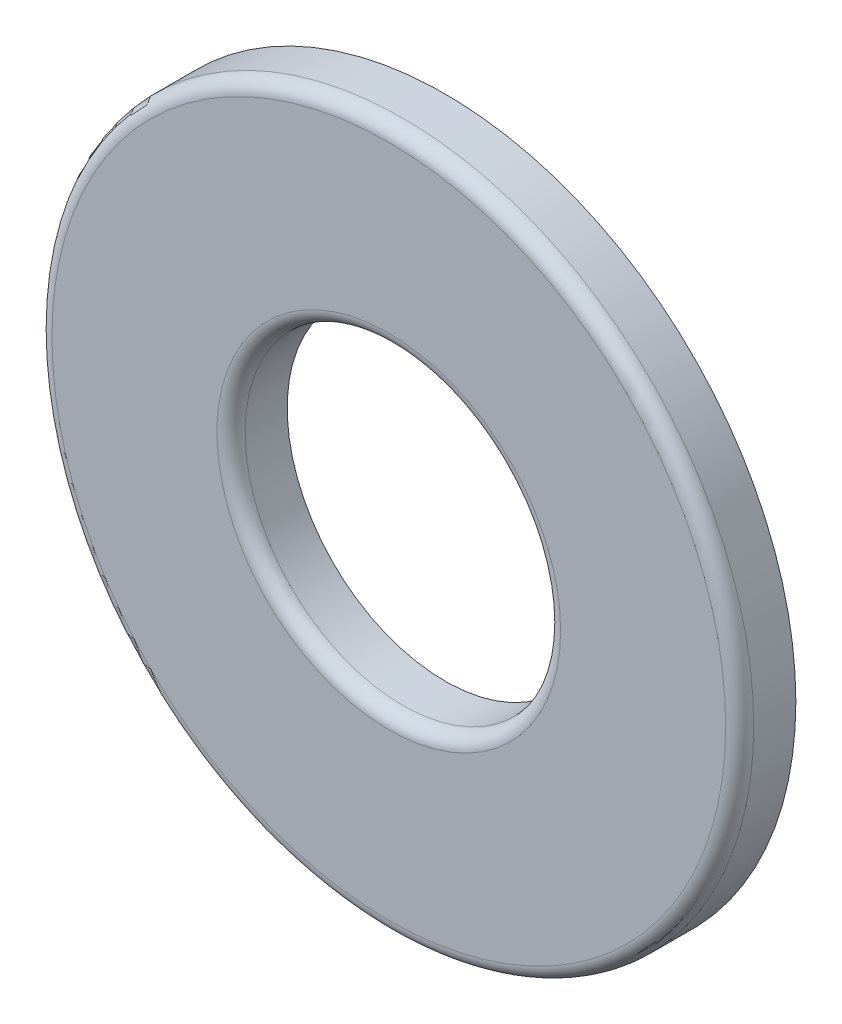
ISO-10303-21;
HEADER;
FILE_DESCRIPTION(('STEP AP214'),'2;1');
FILE_NAME('part.step','',(''),(''),'','','');
FILE_SCHEMA(('AUTOMOTIVE_DESIGN { 1 0 10303 214 1 1 1 1 }'));
ENDSEC;
DATA;
#1=APPLICATION_CONTEXT('core data for automotive mechanical design processes');
#2=APPLICATION_PROTOCOL_DEFINITION('international standard','automotive_design',2000,#1);
#3=PRODUCT_CONTEXT('',#1,'mechanical');
#4=PRODUCT('Part','Part','',(#3));
#5=PRODUCT_RELATED_PRODUCT_CATEGORY('part','',(#4));
#6=PRODUCT_DEFINITION_FORMATION('','',#4);
#7=PRODUCT_DEFINITION_CONTEXT('part definition',#1,'design');
#8=PRODUCT_DEFINITION('design','',#6,#7);
#9=PRODUCT_DEFINITION_SHAPE('','',#8);
#10=(LENGTH_UNIT() NAMED_UNIT(*) SI_UNIT(.MILLI.,.METRE.));
#11=(NAMED_UNIT(*) PLANE_ANGLE_UNIT() SI_UNIT($,.RADIAN.));
#12=(NAMED_UNIT(*) SI_UNIT($,.STERADIAN.) SOLID_ANGLE_UNIT());
#13=UNCERTAINTY_MEASURE_WITH_UNIT(LENGTH_MEASURE(1.E-05),#10,'distance_accuracy_value','');
#14=(GEOMETRIC_REPRESENTATION_CONTEXT(3) GLOBAL_UNCERTAINTY_ASSIGNED_CONTEXT((#13)) GLOBAL_UNIT_ASSIGNED_CONTEXT((#10,
#11,#12)) REPRESENTATION_CONTEXT('',''));
#15=CARTESIAN_POINT('',(0.,0.,0.));
#16=DIRECTION('',(0.,0.,1.));
#17=DIRECTION('',(1.,0.,0.));
#18=AXIS2_PLACEMENT_3D('',#15,#16,#17);
#19=CARTESIAN_POINT('',(0.,0.,0.634999999999997));
#20=DIRECTION('',(0.,0.,1.));
#21=DIRECTION('',(1.,0.,0.));
#22=AXIS2_PLACEMENT_3D('',#19,#20,#21);
#23=PLANE('',#22);
#24=CARTESIAN_POINT('',(0.,0.,0.634999999999997));
#25=DIRECTION('',(0.,0.,1.));
#26=DIRECTION('',(1.,0.,0.));
#27=AXIS2_PLACEMENT_3D('',#24,#25,#26);
#28=CIRCLE('',#27,7.62);
#29=CARTESIAN_POINT('',(7.62,0.,0.634999999999997));
#30=VERTEX_POINT('',#29);
#31=EDGE_CURVE('E46',#30,#30,#28,.T.);
#32=ORIENTED_EDGE('',*,*,#31,.T.);
#33=EDGE_LOOP('',(#32));
#34=FACE_BOUND('',#33,.T.);
#35=CARTESIAN_POINT('',(0.,0.,0.634999999999997));
#36=DIRECTION('',(0.,0.,1.));
#37=DIRECTION('',(1.,0.,0.));
#38=AXIS2_PLACEMENT_3D('',#35,#36,#37);
#39=CIRCLE('',#38,3.8862);
#40=CARTESIAN_POINT('',(3.8862,0.,0.634999999999997));
#41=VERTEX_POINT('',#40);
#42=EDGE_CURVE('E50',#41,#41,#39,.F.);
#43=ORIENTED_EDGE('',*,*,#42,.T.);
#44=EDGE_LOOP('',(#43));
#45=FACE_BOUND('',#44,.T.);
#46=ADVANCED_FACE('F35',(#34,#45),#23,.T.);
#47=CARTESIAN_POINT('',(0.,0.,0.634999999999997));
#48=DIRECTION('',(0.,0.,-1.));
#49=DIRECTION('',(-1.,0.,0.));
#50=AXIS2_PLACEMENT_3D('',#47,#48,#49);
#51=CYLINDRICAL_SURFACE('',#50,7.9375);
#52=CARTESIAN_POINT('',(0.,0.,0.317499999999997));
#53=DIRECTION('',(0.,0.,1.));
#54=DIRECTION('',(1.,0.,0.));
#55=AXIS2_PLACEMENT_3D('',#52,#53,#54);
#56=CIRCLE('',#55,7.9375);
#57=CARTESIAN_POINT('',(7.9375,0.,0.317499999999997));
#58=VERTEX_POINT('',#57);
#59=EDGE_CURVE('E42',#58,#58,#56,.F.);
#60=ORIENTED_EDGE('',*,*,#59,.T.);
#61=EDGE_LOOP('',(#60));
#62=FACE_BOUND('',#61,.T.);
#63=CARTESIAN_POINT('',(0.,0.,-0.635000000000003));
#64=DIRECTION('',(0.,0.,1.));
#65=DIRECTION('',(1.,0.,0.));
#66=AXIS2_PLACEMENT_3D('',#63,#64,#65);
#67=CIRCLE('',#66,7.9375);
#68=CARTESIAN_POINT('',(7.9375,0.,-0.635000000000003));
#69=VERTEX_POINT('',#68);
#70=EDGE_CURVE('E55',#69,#69,#67,.T.);
#71=ORIENTED_EDGE('',*,*,#70,.T.);
#72=EDGE_LOOP('',(#71));
#73=FACE_BOUND('',#72,.T.);
#74=ADVANCED_FACE('F67',(#62,#73),#51,.T.);
#75=CARTESIAN_POINT('',(0.,0.,0.634999999999997));
#76=DIRECTION('',(0.,0.,-1.));
#77=DIRECTION('',(-1.,0.,0.));
#78=AXIS2_PLACEMENT_3D('',#75,#76,#77);
#79=CYLINDRICAL_SURFACE('',#78,3.5687);
#80=CARTESIAN_POINT('',(0.,0.,0.317499999999997));
#81=DIRECTION('',(0.,0.,1.));
#82=DIRECTION('',(1.,0.,0.));
#83=AXIS2_PLACEMENT_3D('',#80,#81,#82);
#84=CIRCLE('',#83,3.5687);
#85=CARTESIAN_POINT('',(3.5687,0.,0.317499999999997));
#86=VERTEX_POINT('',#85);
#87=EDGE_CURVE('E10',#86,#86,#84,.T.);
#88=ORIENTED_EDGE('',*,*,#87,.T.);
#89=EDGE_LOOP('',(#88));
#90=FACE_BOUND('',#89,.T.);
#91=CARTESIAN_POINT('',(0.,0.,-0.635000000000003));
#92=DIRECTION('',(0.,0.,1.));
#93=DIRECTION('',(1.,0.,0.));
#94=AXIS2_PLACEMENT_3D('',#91,#92,#93);
#95=CIRCLE('',#94,3.5687);
#96=CARTESIAN_POINT('',(3.5687,0.,-0.635000000000003));
#97=VERTEX_POINT('',#96);
#98=EDGE_CURVE('E58',#97,#97,#95,.T.);
#99=ORIENTED_EDGE('',*,*,#98,.F.);
#100=EDGE_LOOP('',(#99));
#101=FACE_BOUND('',#100,.T.);
#102=ADVANCED_FACE('F65',(#90,#101),#79,.F.);
#103=CARTESIAN_POINT('',(0.,0.,-0.635000000000003));
#104=DIRECTION('',(0.,0.,1.));
#105=DIRECTION('',(1.,0.,0.));
#106=AXIS2_PLACEMENT_3D('',#103,#104,#105);
#107=PLANE('',#106);
#108=ORIENTED_EDGE('',*,*,#98,.T.);
#109=EDGE_LOOP('',(#108));
#110=FACE_BOUND('',#109,.T.);
#111=ORIENTED_EDGE('',*,*,#70,.F.);
#112=EDGE_LOOP('',(#111));
#113=FACE_BOUND('',#112,.T.);
#114=ADVANCED_FACE('F62',(#110,#113),#107,.F.);
#115=CARTESIAN_POINT('',(0.,0.,0.317499999999997));
#116=DIRECTION('',(0.,0.,1.));
#117=DIRECTION('',(1.,0.,0.));
#118=AXIS2_PLACEMENT_3D('',#115,#116,#117);
#119=TOROIDAL_SURFACE('',#118,7.62,0.3175);
#120=ORIENTED_EDGE('',*,*,#59,.F.);
#121=EDGE_LOOP('',(#120));
#122=FACE_BOUND('',#121,.T.);
#123=ORIENTED_EDGE('',*,*,#31,.F.);
#124=EDGE_LOOP('',(#123));
#125=FACE_BOUND('',#124,.T.);
#126=ADVANCED_FACE('F73',(#122,#125),#119,.T.);
#127=CARTESIAN_POINT('',(0.,0.,0.317499999999997));
#128=DIRECTION('',(0.,0.,1.));
#129=DIRECTION('',(1.,0.,0.));
#130=AXIS2_PLACEMENT_3D('',#127,#128,#129);
#131=TOROIDAL_SURFACE('',#130,3.8862,0.3175);
#132=ORIENTED_EDGE('',*,*,#42,.F.);
#133=EDGE_LOOP('',(#132));
#134=FACE_BOUND('',#133,.T.);
#135=ORIENTED_EDGE('',*,*,#87,.F.);
#136=EDGE_LOOP('',(#135));
#137=FACE_BOUND('',#136,.T.);
#138=ADVANCED_FACE('F37',(#134,#137),#131,.T.);
#139=CLOSED_SHELL('',(#46,#74,#102,#114,#126,#138));
#140=MANIFOLD_SOLID_BREP('B2',#139);
#141=ADVANCED_BREP_SHAPE_REPRESENTATION('',(#18,#140),#14);
#142=SHAPE_DEFINITION_REPRESENTATION(#9,#141);
ENDSEC;
END-ISO-10303-21;
